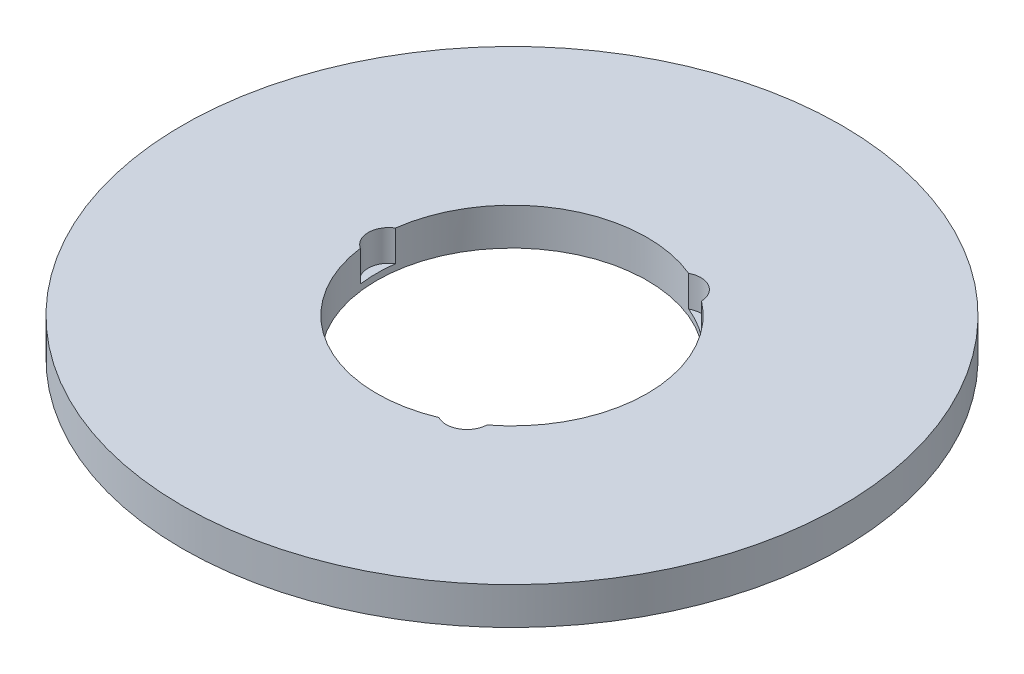
ISO-10303-21;
HEADER;
FILE_DESCRIPTION(('STEP AP214'),'2;1');
FILE_NAME('part.step','',(''),(''),'','','');
FILE_SCHEMA(('AUTOMOTIVE_DESIGN { 1 0 10303 214 1 1 1 1 }'));
ENDSEC;
DATA;
#1=APPLICATION_CONTEXT('core data for automotive mechanical design processes');
#2=APPLICATION_PROTOCOL_DEFINITION('international standard','automotive_design',2000,#1);
#3=PRODUCT_CONTEXT('',#1,'mechanical');
#4=PRODUCT('Part','Part','',(#3));
#5=PRODUCT_RELATED_PRODUCT_CATEGORY('part','',(#4));
#6=PRODUCT_DEFINITION_FORMATION('','',#4);
#7=PRODUCT_DEFINITION_CONTEXT('part definition',#1,'design');
#8=PRODUCT_DEFINITION('design','',#6,#7);
#9=PRODUCT_DEFINITION_SHAPE('','',#8);
#10=(LENGTH_UNIT() NAMED_UNIT(*) SI_UNIT(.MILLI.,.METRE.));
#11=(NAMED_UNIT(*) PLANE_ANGLE_UNIT() SI_UNIT($,.RADIAN.));
#12=(NAMED_UNIT(*) SI_UNIT($,.STERADIAN.) SOLID_ANGLE_UNIT());
#13=UNCERTAINTY_MEASURE_WITH_UNIT(LENGTH_MEASURE(1.E-05),#10,'distance_accuracy_value','');
#14=(GEOMETRIC_REPRESENTATION_CONTEXT(3) GLOBAL_UNCERTAINTY_ASSIGNED_CONTEXT((#13)) GLOBAL_UNIT_ASSIGNED_CONTEXT((#10,
#11,#12)) REPRESENTATION_CONTEXT('',''));
#15=CARTESIAN_POINT('',(0.,0.,0.));
#16=DIRECTION('',(0.,0.,1.));
#17=DIRECTION('',(1.,0.,0.));
#18=AXIS2_PLACEMENT_3D('',#15,#16,#17);
#19=CARTESIAN_POINT('',(0.,11.,0.));
#20=DIRECTION('',(0.,-1.,0.));
#21=DIRECTION('',(0.,0.,-1.));
#22=AXIS2_PLACEMENT_3D('',#19,#20,#21);
#23=CYLINDRICAL_SURFACE('',#22,97.5);
#24=CARTESIAN_POINT('',(0.,11.,0.));
#25=DIRECTION('',(0.,1.,0.));
#26=DIRECTION('',(0.,0.,1.));
#27=AXIS2_PLACEMENT_3D('',#24,#25,#26);
#28=CIRCLE('',#27,97.5);
#29=CARTESIAN_POINT('',(0.,11.,97.5));
#30=VERTEX_POINT('',#29);
#31=EDGE_CURVE('E130',#30,#30,#28,.T.);
#32=ORIENTED_EDGE('',*,*,#31,.F.);
#33=EDGE_LOOP('',(#32));
#34=FACE_BOUND('',#33,.T.);
#35=CARTESIAN_POINT('',(0.,0.,0.));
#36=DIRECTION('',(0.,1.,0.));
#37=DIRECTION('',(0.,0.,1.));
#38=AXIS2_PLACEMENT_3D('',#35,#36,#37);
#39=CIRCLE('',#38,97.5);
#40=CARTESIAN_POINT('',(0.,0.,97.5));
#41=VERTEX_POINT('',#40);
#42=EDGE_CURVE('E117',#41,#41,#39,.T.);
#43=ORIENTED_EDGE('',*,*,#42,.T.);
#44=EDGE_LOOP('',(#43));
#45=FACE_BOUND('',#44,.T.);
#46=ADVANCED_FACE('F39',(#34,#45),#23,.T.);
#47=CARTESIAN_POINT('',(0.,11.,0.));
#48=DIRECTION('',(0.,1.,0.));
#49=DIRECTION('',(0.,0.,1.));
#50=AXIS2_PLACEMENT_3D('',#47,#48,#49);
#51=PLANE('',#50);
#52=CARTESIAN_POINT('',(18.2167276826826,11.,31.5522978940523));
#53=DIRECTION('',(0.,1.,0.));
#54=DIRECTION('',(0.866025403784436,0.,-0.500000000000004));
#55=AXIS2_PLACEMENT_3D('',#52,#53,#54);
#56=CIRCLE('',#55,6.11141992051628);
#57=CARTESIAN_POINT('',(15.3371720125496,11.,36.9428092415488));
#58=VERTEX_POINT('',#57);
#59=CARTESIAN_POINT('',(24.3248252840693,11.,31.7537852058539));
#60=VERTEX_POINT('',#59);
#61=EDGE_CURVE('E148',#58,#60,#56,.T.);
#62=ORIENTED_EDGE('',*,*,#61,.F.);
#63=CARTESIAN_POINT('',(0.,11.,0.));
#64=DIRECTION('',(0.,1.,0.));
#65=DIRECTION('',(0.,0.,1.));
#66=AXIS2_PLACEMENT_3D('',#63,#64,#65);
#67=CIRCLE('',#66,40.);
#68=CARTESIAN_POINT('',(-39.6619972966186,11.,5.18902403569491));
#69=VERTEX_POINT('',#68);
#70=EDGE_CURVE('E113',#69,#58,#67,.T.);
#71=ORIENTED_EDGE('',*,*,#70,.F.);
#72=CARTESIAN_POINT('',(-36.4334553653648,11.,0.));
#73=DIRECTION('',(0.,1.,0.));
#74=DIRECTION('',(0.,0.,1.));
#75=AXIS2_PLACEMENT_3D('',#72,#73,#74);
#76=CIRCLE('',#75,6.11141992051628);
#77=CARTESIAN_POINT('',(-39.6619972966186,11.,-5.18902403569491));
#78=VERTEX_POINT('',#77);
#79=EDGE_CURVE('E125',#78,#69,#76,.T.);
#80=ORIENTED_EDGE('',*,*,#79,.F.);
#81=CARTESIAN_POINT('',(15.3371720125491,11.,-36.942809241549));
#82=VERTEX_POINT('',#81);
#83=EDGE_CURVE('E107',#82,#78,#67,.T.);
#84=ORIENTED_EDGE('',*,*,#83,.F.);
#85=CARTESIAN_POINT('',(18.2167276826821,11.,-31.5522978940526));
#86=DIRECTION('',(0.,1.,0.));
#87=DIRECTION('',(-0.866025403784443,0.,-0.499999999999992));
#88=AXIS2_PLACEMENT_3D('',#85,#86,#87);
#89=CIRCLE('',#88,6.11141992051628);
#90=CARTESIAN_POINT('',(24.3248252840688,11.,-31.7537852058542));
#91=VERTEX_POINT('',#90);
#92=EDGE_CURVE('E95',#91,#82,#89,.T.);
#93=ORIENTED_EDGE('',*,*,#92,.F.);
#94=EDGE_CURVE('E106',#60,#91,#67,.T.);
#95=ORIENTED_EDGE('',*,*,#94,.F.);
#96=EDGE_LOOP('',(#62,#71,#80,#84,#93,#95));
#97=FACE_BOUND('',#96,.T.);
#98=ORIENTED_EDGE('',*,*,#31,.T.);
#99=EDGE_LOOP('',(#98));
#100=FACE_BOUND('',#99,.T.);
#101=ADVANCED_FACE('F102',(#97,#100),#51,.T.);
#102=CARTESIAN_POINT('',(0.,0.,0.));
#103=DIRECTION('',(0.,1.,0.));
#104=DIRECTION('',(0.,0.,1.));
#105=AXIS2_PLACEMENT_3D('',#102,#103,#104);
#106=PLANE('',#105);
#107=CARTESIAN_POINT('',(0.,0.,0.));
#108=DIRECTION('',(0.,1.,0.));
#109=DIRECTION('',(0.,0.,1.));
#110=AXIS2_PLACEMENT_3D('',#107,#108,#109);
#111=CIRCLE('',#110,40.);
#112=CARTESIAN_POINT('',(0.,0.,40.));
#113=VERTEX_POINT('',#112);
#114=EDGE_CURVE('E118',#113,#113,#111,.T.);
#115=ORIENTED_EDGE('',*,*,#114,.T.);
#116=EDGE_LOOP('',(#115));
#117=FACE_BOUND('',#116,.T.);
#118=ORIENTED_EDGE('',*,*,#42,.F.);
#119=EDGE_LOOP('',(#118));
#120=FACE_BOUND('',#119,.T.);
#121=ADVANCED_FACE('F161',(#117,#120),#106,.F.);
#122=CARTESIAN_POINT('',(0.,11.,0.));
#123=DIRECTION('',(0.,-1.,0.));
#124=DIRECTION('',(0.,0.,-1.));
#125=AXIS2_PLACEMENT_3D('',#122,#123,#124);
#126=CYLINDRICAL_SURFACE('',#125,40.);
#127=DIRECTION('',(0.,1.,0.));
#128=VECTOR('',#127,1.);
#129=CARTESIAN_POINT('',(15.3371720125496,6.42661083551062,36.9428092415488));
#130=LINE('',#129,#128);
#131=CARTESIAN_POINT('',(15.3371720125496,1.85322167102125,36.9428092415488));
#132=VERTEX_POINT('',#131);
#133=EDGE_CURVE('E11',#132,#58,#130,.T.);
#134=ORIENTED_EDGE('',*,*,#133,.F.);
#135=CARTESIAN_POINT('',(0.,1.85322167102125,0.));
#136=DIRECTION('',(0.,1.,0.));
#137=DIRECTION('',(0.,0.,1.));
#138=AXIS2_PLACEMENT_3D('',#135,#136,#137);
#139=CIRCLE('',#138,40.);
#140=CARTESIAN_POINT('',(24.3248252840693,1.85322167102125,31.7537852058539));
#141=VERTEX_POINT('',#140);
#142=EDGE_CURVE('E100',#132,#141,#139,.T.);
#143=ORIENTED_EDGE('',*,*,#142,.T.);
#144=DIRECTION('',(0.,1.,0.));
#145=VECTOR('',#144,1.);
#146=CARTESIAN_POINT('',(24.3248252840693,6.42661083551062,31.7537852058539));
#147=LINE('',#146,#145);
#148=EDGE_CURVE('E46',#60,#141,#147,.F.);
#149=ORIENTED_EDGE('',*,*,#148,.F.);
#150=ORIENTED_EDGE('',*,*,#94,.T.);
#151=DIRECTION('',(0.,1.,0.));
#152=VECTOR('',#151,1.);
#153=CARTESIAN_POINT('',(24.3248252840688,6.42661083551062,-31.7537852058542));
#154=LINE('',#153,#152);
#155=CARTESIAN_POINT('',(24.3248252840688,1.85322167102125,-31.7537852058542));
#156=VERTEX_POINT('',#155);
#157=EDGE_CURVE('E90',#156,#91,#154,.T.);
#158=ORIENTED_EDGE('',*,*,#157,.F.);
#159=CARTESIAN_POINT('',(0.,1.85322167102125,0.));
#160=DIRECTION('',(0.,1.,0.));
#161=DIRECTION('',(0.,0.,1.));
#162=AXIS2_PLACEMENT_3D('',#159,#160,#161);
#163=CIRCLE('',#162,40.);
#164=CARTESIAN_POINT('',(15.3371720125491,1.85322167102125,-36.942809241549));
#165=VERTEX_POINT('',#164);
#166=EDGE_CURVE('E143',#156,#165,#163,.T.);
#167=ORIENTED_EDGE('',*,*,#166,.T.);
#168=DIRECTION('',(0.,1.,0.));
#169=VECTOR('',#168,1.);
#170=CARTESIAN_POINT('',(15.3371720125491,6.42661083551062,-36.942809241549));
#171=LINE('',#170,#169);
#172=EDGE_CURVE('E98',#82,#165,#171,.F.);
#173=ORIENTED_EDGE('',*,*,#172,.F.);
#174=ORIENTED_EDGE('',*,*,#83,.T.);
#175=DIRECTION('',(0.,1.,0.));
#176=VECTOR('',#175,1.);
#177=CARTESIAN_POINT('',(-39.6619972966186,6.42661083551062,-5.18902403569491));
#178=LINE('',#177,#176);
#179=CARTESIAN_POINT('',(-39.6619972966186,1.85322167102125,-5.18902403569491));
#180=VERTEX_POINT('',#179);
#181=EDGE_CURVE('E137',#180,#78,#178,.T.);
#182=ORIENTED_EDGE('',*,*,#181,.F.);
#183=CARTESIAN_POINT('',(0.,1.85322167102125,0.));
#184=DIRECTION('',(0.,1.,0.));
#185=DIRECTION('',(0.,0.,1.));
#186=AXIS2_PLACEMENT_3D('',#183,#184,#185);
#187=CIRCLE('',#186,40.);
#188=CARTESIAN_POINT('',(-39.6619972966186,1.85322167102125,5.18902403569491));
#189=VERTEX_POINT('',#188);
#190=EDGE_CURVE('E128',#180,#189,#187,.T.);
#191=ORIENTED_EDGE('',*,*,#190,.T.);
#192=DIRECTION('',(0.,1.,0.));
#193=VECTOR('',#192,1.);
#194=CARTESIAN_POINT('',(-39.6619972966186,6.42661083551062,5.18902403569491));
#195=LINE('',#194,#193);
#196=EDGE_CURVE('E134',#69,#189,#195,.F.);
#197=ORIENTED_EDGE('',*,*,#196,.F.);
#198=ORIENTED_EDGE('',*,*,#70,.T.);
#199=EDGE_LOOP('',(#134,#143,#149,#150,#158,#167,#173,#174,#182,#191,#197,#198));
#200=FACE_BOUND('',#199,.T.);
#201=ORIENTED_EDGE('',*,*,#114,.F.);
#202=EDGE_LOOP('',(#201));
#203=FACE_BOUND('',#202,.T.);
#204=ADVANCED_FACE('F115',(#200,#203),#126,.F.);
#205=CARTESIAN_POINT('',(-36.4334553653648,1.85322167102125,0.));
#206=DIRECTION('',(0.,1.,0.));
#207=DIRECTION('',(0.,0.,1.));
#208=AXIS2_PLACEMENT_3D('',#205,#206,#207);
#209=CYLINDRICAL_SURFACE('',#208,6.11141992051628);
#210=ORIENTED_EDGE('',*,*,#181,.T.);
#211=ORIENTED_EDGE('',*,*,#79,.T.);
#212=ORIENTED_EDGE('',*,*,#196,.T.);
#213=CARTESIAN_POINT('',(-36.4334553653648,1.85322167102125,0.));
#214=DIRECTION('',(0.,1.,0.));
#215=DIRECTION('',(0.,0.,1.));
#216=AXIS2_PLACEMENT_3D('',#213,#214,#215);
#217=CIRCLE('',#216,6.11141992051628);
#218=EDGE_CURVE('E127',#180,#189,#217,.T.);
#219=ORIENTED_EDGE('',*,*,#218,.F.);
#220=EDGE_LOOP('',(#210,#211,#212,#219));
#221=FACE_BOUND('',#220,.T.);
#222=ADVANCED_FACE('F175',(#221),#209,.F.);
#223=CARTESIAN_POINT('',(-36.4334553653648,1.85322167102125,0.));
#224=DIRECTION('',(0.,1.,0.));
#225=DIRECTION('',(0.,0.,1.));
#226=AXIS2_PLACEMENT_3D('',#223,#224,#225);
#227=PLANE('',#226);
#228=ORIENTED_EDGE('',*,*,#218,.T.);
#229=ORIENTED_EDGE('',*,*,#190,.F.);
#230=EDGE_LOOP('',(#228,#229));
#231=FACE_BOUND('',#230,.T.);
#232=ADVANCED_FACE('F176',(#231),#227,.T.);
#233=CARTESIAN_POINT('',(18.2167276826821,1.85322167102125,-31.5522978940526));
#234=DIRECTION('',(0.,1.,0.));
#235=DIRECTION('',(0.,0.,1.));
#236=AXIS2_PLACEMENT_3D('',#233,#234,#235);
#237=CYLINDRICAL_SURFACE('',#236,6.11141992051628);
#238=ORIENTED_EDGE('',*,*,#157,.T.);
#239=ORIENTED_EDGE('',*,*,#92,.T.);
#240=ORIENTED_EDGE('',*,*,#172,.T.);
#241=CARTESIAN_POINT('',(18.2167276826821,1.85322167102125,-31.5522978940526));
#242=DIRECTION('',(0.,1.,0.));
#243=DIRECTION('',(-0.866025403784443,0.,-0.499999999999992));
#244=AXIS2_PLACEMENT_3D('',#241,#242,#243);
#245=CIRCLE('',#244,6.11141992051628);
#246=EDGE_CURVE('E56',#156,#165,#245,.T.);
#247=ORIENTED_EDGE('',*,*,#246,.F.);
#248=EDGE_LOOP('',(#238,#239,#240,#247));
#249=FACE_BOUND('',#248,.T.);
#250=ADVANCED_FACE('F93',(#249),#237,.F.);
#251=CARTESIAN_POINT('',(18.2167276826821,1.85322167102125,-31.5522978940526));
#252=DIRECTION('',(0.,1.,0.));
#253=DIRECTION('',(-0.866025403784443,0.,-0.499999999999992));
#254=AXIS2_PLACEMENT_3D('',#251,#252,#253);
#255=PLANE('',#254);
#256=ORIENTED_EDGE('',*,*,#246,.T.);
#257=ORIENTED_EDGE('',*,*,#166,.F.);
#258=EDGE_LOOP('',(#256,#257));
#259=FACE_BOUND('',#258,.T.);
#260=ADVANCED_FACE('F153',(#259),#255,.T.);
#261=CARTESIAN_POINT('',(18.2167276826826,1.85322167102125,31.5522978940523));
#262=DIRECTION('',(0.,1.,0.));
#263=DIRECTION('',(0.,0.,1.));
#264=AXIS2_PLACEMENT_3D('',#261,#262,#263);
#265=CYLINDRICAL_SURFACE('',#264,6.11141992051628);
#266=ORIENTED_EDGE('',*,*,#133,.T.);
#267=ORIENTED_EDGE('',*,*,#61,.T.);
#268=ORIENTED_EDGE('',*,*,#148,.T.);
#269=CARTESIAN_POINT('',(18.2167276826826,1.85322167102125,31.5522978940523));
#270=DIRECTION('',(0.,1.,0.));
#271=DIRECTION('',(0.866025403784436,0.,-0.500000000000004));
#272=AXIS2_PLACEMENT_3D('',#269,#270,#271);
#273=CIRCLE('',#272,6.11141992051628);
#274=EDGE_CURVE('E55',#132,#141,#273,.T.);
#275=ORIENTED_EDGE('',*,*,#274,.F.);
#276=EDGE_LOOP('',(#266,#267,#268,#275));
#277=FACE_BOUND('',#276,.T.);
#278=ADVANCED_FACE('F144',(#277),#265,.F.);
#279=CARTESIAN_POINT('',(18.2167276826826,1.85322167102125,31.5522978940523));
#280=DIRECTION('',(0.,1.,0.));
#281=DIRECTION('',(0.866025403784436,0.,-0.500000000000004));
#282=AXIS2_PLACEMENT_3D('',#279,#280,#281);
#283=PLANE('',#282);
#284=ORIENTED_EDGE('',*,*,#274,.T.);
#285=ORIENTED_EDGE('',*,*,#142,.F.);
#286=EDGE_LOOP('',(#284,#285));
#287=FACE_BOUND('',#286,.T.);
#288=ADVANCED_FACE('F150',(#287),#283,.T.);
#289=CLOSED_SHELL('',(#46,#101,#121,#204,#222,#232,#250,#260,#278,#288));
#290=MANIFOLD_SOLID_BREP('B2',#289);
#291=ADVANCED_BREP_SHAPE_REPRESENTATION('',(#18,#290),#14);
#292=SHAPE_DEFINITION_REPRESENTATION(#9,#291);
ENDSEC;
END-ISO-10303-21;
